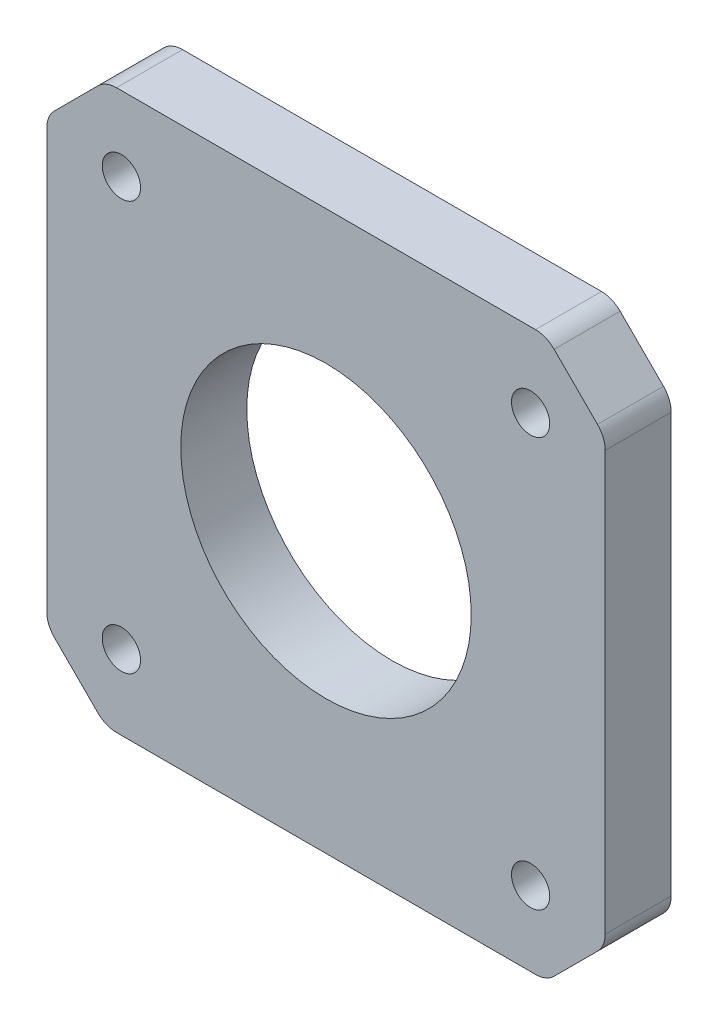
ISO-10303-21;
HEADER;
FILE_DESCRIPTION(('STEP AP214'),'2;1');
FILE_NAME('part.step','',(''),(''),'','','');
FILE_SCHEMA(('AUTOMOTIVE_DESIGN { 1 0 10303 214 1 1 1 1 }'));
ENDSEC;
DATA;
#1=APPLICATION_CONTEXT('core data for automotive mechanical design processes');
#2=APPLICATION_PROTOCOL_DEFINITION('international standard','automotive_design',2000,#1);
#3=PRODUCT_CONTEXT('',#1,'mechanical');
#4=PRODUCT('Part','Part','',(#3));
#5=PRODUCT_RELATED_PRODUCT_CATEGORY('part','',(#4));
#6=PRODUCT_DEFINITION_FORMATION('','',#4);
#7=PRODUCT_DEFINITION_CONTEXT('part definition',#1,'design');
#8=PRODUCT_DEFINITION('design','',#6,#7);
#9=PRODUCT_DEFINITION_SHAPE('','',#8);
#10=(LENGTH_UNIT() NAMED_UNIT(*) SI_UNIT(.MILLI.,.METRE.));
#11=(NAMED_UNIT(*) PLANE_ANGLE_UNIT() SI_UNIT($,.RADIAN.));
#12=(NAMED_UNIT(*) SI_UNIT($,.STERADIAN.) SOLID_ANGLE_UNIT());
#13=UNCERTAINTY_MEASURE_WITH_UNIT(LENGTH_MEASURE(1.E-05),#10,'distance_accuracy_value','');
#14=(GEOMETRIC_REPRESENTATION_CONTEXT(3) GLOBAL_UNCERTAINTY_ASSIGNED_CONTEXT((#13)) GLOBAL_UNIT_ASSIGNED_CONTEXT((#10,
#11,#12)) REPRESENTATION_CONTEXT('',''));
#15=CARTESIAN_POINT('',(0.,0.,0.));
#16=DIRECTION('',(0.,0.,1.));
#17=DIRECTION('',(1.,0.,0.));
#18=AXIS2_PLACEMENT_3D('',#15,#16,#17);
#19=CARTESIAN_POINT('',(-19.1500000000002,-15.867157287526,5.));
#20=DIRECTION('',(0.,0.,1.));
#21=DIRECTION('',(1.,0.,0.));
#22=AXIS2_PLACEMENT_3D('',#19,#20,#21);
#23=PLANE('',#22);
#24=CARTESIAN_POINT('',(0.,0.,5.));
#25=DIRECTION('',(0.,0.,1.));
#26=DIRECTION('',(1.,0.,0.));
#27=AXIS2_PLACEMENT_3D('',#24,#25,#26);
#28=CIRCLE('',#27,11.0000000000002);
#29=CARTESIAN_POINT('',(11.0000000000002,0.,5.));
#30=VERTEX_POINT('',#29);
#31=EDGE_CURVE('E348',#30,#30,#28,.T.);
#32=ORIENTED_EDGE('',*,*,#31,.F.);
#33=EDGE_LOOP('',(#32));
#34=FACE_BOUND('',#33,.T.);
#35=CARTESIAN_POINT('',(15.5000000000001,15.5000000000005,5.));
#36=DIRECTION('',(0.,0.,1.));
#37=DIRECTION('',(1.,0.,0.));
#38=AXIS2_PLACEMENT_3D('',#35,#36,#37);
#39=CIRCLE('',#38,1.45);
#40=CARTESIAN_POINT('',(16.9500000000001,15.5000000000005,5.));
#41=VERTEX_POINT('',#40);
#42=EDGE_CURVE('E360',#41,#41,#39,.T.);
#43=ORIENTED_EDGE('',*,*,#42,.F.);
#44=EDGE_LOOP('',(#43));
#45=FACE_BOUND('',#44,.T.);
#46=CARTESIAN_POINT('',(-19.1500000000002,-15.867157287526,5.));
#47=DIRECTION('',(0.,0.,1.));
#48=DIRECTION('',(1.,0.,0.));
#49=AXIS2_PLACEMENT_3D('',#46,#47,#48);
#50=CIRCLE('',#49,1.99999999999998);
#51=CARTESIAN_POINT('',(-21.1500000000002,-15.867157287526,5.));
#52=VERTEX_POINT('',#51);
#53=CARTESIAN_POINT('',(-20.5642135623731,-17.2813708498992,5.));
#54=VERTEX_POINT('',#53);
#55=EDGE_CURVE('E209',#52,#54,#50,.T.);
#56=ORIENTED_EDGE('',*,*,#55,.T.);
#57=DIRECTION('',(0.707106781186525,-0.70710678118657,0.));
#58=VECTOR('',#57,1.);
#59=CARTESIAN_POINT('',(-20.5642135623731,-17.2813708498992,5.));
#60=LINE('',#59,#58);
#61=CARTESIAN_POINT('',(-17.2813708498986,-20.564213562374,5.));
#62=VERTEX_POINT('',#61);
#63=EDGE_CURVE('E117',#54,#62,#60,.T.);
#64=ORIENTED_EDGE('',*,*,#63,.T.);
#65=CARTESIAN_POINT('',(-15.8671572875255,-19.150000000001,5.));
#66=DIRECTION('',(0.,0.,1.));
#67=DIRECTION('',(1.,0.,0.));
#68=AXIS2_PLACEMENT_3D('',#65,#66,#67);
#69=CIRCLE('',#68,1.99999999999994);
#70=CARTESIAN_POINT('',(-15.8671572875254,-21.1500000000009,5.));
#71=VERTEX_POINT('',#70);
#72=EDGE_CURVE('E248',#62,#71,#69,.T.);
#73=ORIENTED_EDGE('',*,*,#72,.T.);
#74=DIRECTION('',(1.,0.,0.));
#75=VECTOR('',#74,1.);
#76=CARTESIAN_POINT('',(-15.8671572875254,-21.150000000001,5.));
#77=LINE('',#76,#75);
#78=CARTESIAN_POINT('',(15.867157287526,-21.1500000000001,5.));
#79=VERTEX_POINT('',#78);
#80=EDGE_CURVE('E267',#71,#79,#77,.T.);
#81=ORIENTED_EDGE('',*,*,#80,.T.);
#82=CARTESIAN_POINT('',(15.8671572875261,-19.1500000000001,5.));
#83=DIRECTION('',(0.,0.,1.));
#84=DIRECTION('',(1.,0.,0.));
#85=AXIS2_PLACEMENT_3D('',#82,#83,#84);
#86=CIRCLE('',#85,2.00000000000002);
#87=CARTESIAN_POINT('',(17.2813708498991,-20.5642135623733,5.));
#88=VERTEX_POINT('',#87);
#89=EDGE_CURVE('E264',#79,#88,#86,.T.);
#90=ORIENTED_EDGE('',*,*,#89,.T.);
#91=DIRECTION('',(0.707106781186554,0.707106781186542,0.));
#92=VECTOR('',#91,1.);
#93=CARTESIAN_POINT('',(17.2813708498991,-20.5642135623733,5.));
#94=LINE('',#93,#92);
#95=CARTESIAN_POINT('',(20.5642135623738,-17.2813708498987,5.));
#96=VERTEX_POINT('',#95);
#97=EDGE_CURVE('E266',#88,#96,#94,.T.);
#98=ORIENTED_EDGE('',*,*,#97,.T.);
#99=CARTESIAN_POINT('',(19.1500000000006,-15.8671572875255,5.));
#100=DIRECTION('',(0.,0.,1.));
#101=DIRECTION('',(1.,0.,0.));
#102=AXIS2_PLACEMENT_3D('',#99,#100,#101);
#103=CIRCLE('',#102,2.00000000000008);
#104=CARTESIAN_POINT('',(21.1500000000007,-15.8671572875255,5.));
#105=VERTEX_POINT('',#104);
#106=EDGE_CURVE('E269',#96,#105,#103,.T.);
#107=ORIENTED_EDGE('',*,*,#106,.T.);
#108=DIRECTION('',(0.,1.,0.));
#109=VECTOR('',#108,1.);
#110=CARTESIAN_POINT('',(21.1500000000007,-15.8671572875255,5.));
#111=LINE('',#110,#109);
#112=CARTESIAN_POINT('',(21.15,15.867157287526,5.));
#113=VERTEX_POINT('',#112);
#114=EDGE_CURVE('E275',#105,#113,#111,.T.);
#115=ORIENTED_EDGE('',*,*,#114,.T.);
#116=CARTESIAN_POINT('',(19.15,15.8671572875262,5.));
#117=DIRECTION('',(0.,0.,1.));
#118=DIRECTION('',(1.,0.,0.));
#119=AXIS2_PLACEMENT_3D('',#116,#117,#118);
#120=CIRCLE('',#119,1.99999999999995);
#121=CARTESIAN_POINT('',(20.5642135623732,17.2813708498992,5.));
#122=VERTEX_POINT('',#121);
#123=EDGE_CURVE('E277',#113,#122,#120,.T.);
#124=ORIENTED_EDGE('',*,*,#123,.T.);
#125=DIRECTION('',(-0.707106781186583,0.707106781186512,0.));
#126=VECTOR('',#125,1.);
#127=CARTESIAN_POINT('',(20.5642135623732,17.2813708498991,5.));
#128=LINE('',#127,#126);
#129=CARTESIAN_POINT('',(17.2813708498986,20.5642135623734,5.));
#130=VERTEX_POINT('',#129);
#131=EDGE_CURVE('E279',#122,#130,#128,.T.);
#132=ORIENTED_EDGE('',*,*,#131,.T.);
#133=CARTESIAN_POINT('',(15.8671572875256,19.1500000000004,5.));
#134=DIRECTION('',(0.,0.,1.));
#135=DIRECTION('',(1.,0.,0.));
#136=AXIS2_PLACEMENT_3D('',#133,#134,#135);
#137=CIRCLE('',#136,1.99999999999991);
#138=CARTESIAN_POINT('',(15.8671572875255,21.1500000000003,5.));
#139=VERTEX_POINT('',#138);
#140=EDGE_CURVE('E281',#130,#139,#137,.T.);
#141=ORIENTED_EDGE('',*,*,#140,.T.);
#142=DIRECTION('',(-1.,0.,0.));
#143=VECTOR('',#142,1.);
#144=CARTESIAN_POINT('',(15.8671572875255,21.1500000000003,5.));
#145=LINE('',#144,#143);
#146=CARTESIAN_POINT('',(-15.8671572875258,21.1500000000005,5.));
#147=VERTEX_POINT('',#146);
#148=EDGE_CURVE('E283',#139,#147,#145,.T.);
#149=ORIENTED_EDGE('',*,*,#148,.T.);
#150=CARTESIAN_POINT('',(-15.8671572875258,19.1500000000005,5.));
#151=DIRECTION('',(0.,0.,1.));
#152=DIRECTION('',(1.,0.,0.));
#153=AXIS2_PLACEMENT_3D('',#150,#151,#152);
#154=CIRCLE('',#153,2.00000000000003);
#155=CARTESIAN_POINT('',(-17.2813708498988,20.5642135623737,5.));
#156=VERTEX_POINT('',#155);
#157=EDGE_CURVE('E160',#147,#156,#154,.T.);
#158=ORIENTED_EDGE('',*,*,#157,.T.);
#159=DIRECTION('',(-0.707106781186592,-0.707106781186503,0.));
#160=VECTOR('',#159,1.);
#161=CARTESIAN_POINT('',(-17.2813708498988,20.5642135623738,5.));
#162=LINE('',#161,#160);
#163=CARTESIAN_POINT('',(-20.5642135623736,17.2813708498994,5.));
#164=VERTEX_POINT('',#163);
#165=EDGE_CURVE('E154',#156,#164,#162,.T.);
#166=ORIENTED_EDGE('',*,*,#165,.T.);
#167=CARTESIAN_POINT('',(-19.1500000000005,15.8671572875261,5.));
#168=DIRECTION('',(0.,0.,1.));
#169=DIRECTION('',(1.,0.,0.));
#170=AXIS2_PLACEMENT_3D('',#167,#168,#169);
#171=CIRCLE('',#170,2.00000000000013);
#172=CARTESIAN_POINT('',(-21.1500000000006,15.8671572875261,5.));
#173=VERTEX_POINT('',#172);
#174=EDGE_CURVE('E158',#164,#173,#171,.T.);
#175=ORIENTED_EDGE('',*,*,#174,.T.);
#176=DIRECTION('',(0.,-1.,0.));
#177=VECTOR('',#176,1.);
#178=CARTESIAN_POINT('',(-21.1500000000006,15.8671572875261,5.));
#179=LINE('',#178,#177);
#180=EDGE_CURVE('E50',#173,#52,#179,.T.);
#181=ORIENTED_EDGE('',*,*,#180,.T.);
#182=EDGE_LOOP('',(#56,#64,#73,#81,#90,#98,#107,#115,#124,#132,#141,#149,#158,#166,#175,#181));
#183=FACE_BOUND('',#182,.T.);
#184=CARTESIAN_POINT('',(-15.5000000000003,15.5000000000005,5.));
#185=DIRECTION('',(0.,0.,1.));
#186=DIRECTION('',(1.,0.,0.));
#187=AXIS2_PLACEMENT_3D('',#184,#185,#186);
#188=CIRCLE('',#187,1.45);
#189=CARTESIAN_POINT('',(-14.0500000000003,15.5000000000005,5.));
#190=VERTEX_POINT('',#189);
#191=EDGE_CURVE('E182',#190,#190,#188,.T.);
#192=ORIENTED_EDGE('',*,*,#191,.F.);
#193=EDGE_LOOP('',(#192));
#194=FACE_BOUND('',#193,.T.);
#195=CARTESIAN_POINT('',(15.5000000000004,-15.5000000000001,5.));
#196=DIRECTION('',(0.,0.,1.));
#197=DIRECTION('',(1.,0.,0.));
#198=AXIS2_PLACEMENT_3D('',#195,#196,#197);
#199=CIRCLE('',#198,1.45);
#200=CARTESIAN_POINT('',(16.9500000000004,-15.5000000000001,5.));
#201=VERTEX_POINT('',#200);
#202=EDGE_CURVE('E354',#201,#201,#199,.T.);
#203=ORIENTED_EDGE('',*,*,#202,.F.);
#204=EDGE_LOOP('',(#203));
#205=FACE_BOUND('',#204,.T.);
#206=CARTESIAN_POINT('',(-15.5000000000003,-15.5000000000001,5.));
#207=DIRECTION('',(0.,0.,1.));
#208=DIRECTION('',(1.,0.,0.));
#209=AXIS2_PLACEMENT_3D('',#206,#207,#208);
#210=CIRCLE('',#209,1.45);
#211=CARTESIAN_POINT('',(-14.0500000000003,-15.5000000000001,5.));
#212=VERTEX_POINT('',#211);
#213=EDGE_CURVE('E339',#212,#212,#210,.T.);
#214=ORIENTED_EDGE('',*,*,#213,.F.);
#215=EDGE_LOOP('',(#214));
#216=FACE_BOUND('',#215,.T.);
#217=ADVANCED_FACE('F33',(#34,#45,#183,#194,#205,#216),#23,.T.);
#218=CARTESIAN_POINT('',(-19.1500000000002,-15.867157287526,0.));
#219=DIRECTION('',(0.,0.,1.));
#220=DIRECTION('',(1.,0.,0.));
#221=AXIS2_PLACEMENT_3D('',#218,#219,#220);
#222=PLANE('',#221);
#223=CARTESIAN_POINT('',(0.,0.,0.));
#224=DIRECTION('',(0.,0.,1.));
#225=DIRECTION('',(1.,0.,0.));
#226=AXIS2_PLACEMENT_3D('',#223,#224,#225);
#227=CIRCLE('',#226,11.0000000000002);
#228=CARTESIAN_POINT('',(11.0000000000002,0.,0.));
#229=VERTEX_POINT('',#228);
#230=EDGE_CURVE('E345',#229,#229,#227,.T.);
#231=ORIENTED_EDGE('',*,*,#230,.T.);
#232=EDGE_LOOP('',(#231));
#233=FACE_BOUND('',#232,.T.);
#234=CARTESIAN_POINT('',(15.5000000000001,15.5000000000005,0.));
#235=DIRECTION('',(0.,0.,1.));
#236=DIRECTION('',(1.,0.,0.));
#237=AXIS2_PLACEMENT_3D('',#234,#235,#236);
#238=CIRCLE('',#237,1.45);
#239=CARTESIAN_POINT('',(16.9500000000001,15.5000000000005,0.));
#240=VERTEX_POINT('',#239);
#241=EDGE_CURVE('E357',#240,#240,#238,.T.);
#242=ORIENTED_EDGE('',*,*,#241,.T.);
#243=EDGE_LOOP('',(#242));
#244=FACE_BOUND('',#243,.T.);
#245=CARTESIAN_POINT('',(-19.1500000000002,-15.867157287526,0.));
#246=DIRECTION('',(0.,0.,1.));
#247=DIRECTION('',(1.,0.,0.));
#248=AXIS2_PLACEMENT_3D('',#245,#246,#247);
#249=CIRCLE('',#248,1.99999999999998);
#250=CARTESIAN_POINT('',(-21.1500000000002,-15.867157287526,0.));
#251=VERTEX_POINT('',#250);
#252=CARTESIAN_POINT('',(-20.5642135623731,-17.2813708498992,0.));
#253=VERTEX_POINT('',#252);
#254=EDGE_CURVE('E178',#251,#253,#249,.T.);
#255=ORIENTED_EDGE('',*,*,#254,.F.);
#256=DIRECTION('',(0.,-1.,0.));
#257=VECTOR('',#256,1.);
#258=CARTESIAN_POINT('',(-21.1500000000006,15.8671572875261,0.));
#259=LINE('',#258,#257);
#260=CARTESIAN_POINT('',(-21.1500000000006,15.8671572875261,0.));
#261=VERTEX_POINT('',#260);
#262=EDGE_CURVE('E109',#261,#251,#259,.T.);
#263=ORIENTED_EDGE('',*,*,#262,.F.);
#264=CARTESIAN_POINT('',(-19.1500000000005,15.8671572875261,0.));
#265=DIRECTION('',(0.,0.,1.));
#266=DIRECTION('',(1.,0.,0.));
#267=AXIS2_PLACEMENT_3D('',#264,#265,#266);
#268=CIRCLE('',#267,2.00000000000013);
#269=CARTESIAN_POINT('',(-20.5642135623736,17.2813708498994,0.));
#270=VERTEX_POINT('',#269);
#271=EDGE_CURVE('E103',#270,#261,#268,.T.);
#272=ORIENTED_EDGE('',*,*,#271,.F.);
#273=DIRECTION('',(-0.707106781186592,-0.707106781186503,0.));
#274=VECTOR('',#273,1.);
#275=CARTESIAN_POINT('',(-17.2813708498988,20.5642135623738,0.));
#276=LINE('',#275,#274);
#277=CARTESIAN_POINT('',(-17.2813708498988,20.5642135623737,0.));
#278=VERTEX_POINT('',#277);
#279=EDGE_CURVE('E168',#278,#270,#276,.T.);
#280=ORIENTED_EDGE('',*,*,#279,.F.);
#281=CARTESIAN_POINT('',(-15.8671572875258,19.1500000000005,0.));
#282=DIRECTION('',(0.,0.,1.));
#283=DIRECTION('',(1.,0.,0.));
#284=AXIS2_PLACEMENT_3D('',#281,#282,#283);
#285=CIRCLE('',#284,2.00000000000003);
#286=CARTESIAN_POINT('',(-15.8671572875258,21.1500000000005,0.));
#287=VERTEX_POINT('',#286);
#288=EDGE_CURVE('E204',#287,#278,#285,.T.);
#289=ORIENTED_EDGE('',*,*,#288,.F.);
#290=DIRECTION('',(-1.,0.,0.));
#291=VECTOR('',#290,1.);
#292=CARTESIAN_POINT('',(15.8671572875255,21.1500000000003,0.));
#293=LINE('',#292,#291);
#294=CARTESIAN_POINT('',(15.8671572875255,21.1500000000003,0.));
#295=VERTEX_POINT('',#294);
#296=EDGE_CURVE('E202',#295,#287,#293,.T.);
#297=ORIENTED_EDGE('',*,*,#296,.F.);
#298=CARTESIAN_POINT('',(15.8671572875256,19.1500000000004,0.));
#299=DIRECTION('',(0.,0.,1.));
#300=DIRECTION('',(1.,0.,0.));
#301=AXIS2_PLACEMENT_3D('',#298,#299,#300);
#302=CIRCLE('',#301,1.99999999999991);
#303=CARTESIAN_POINT('',(17.2813708498986,20.5642135623734,0.));
#304=VERTEX_POINT('',#303);
#305=EDGE_CURVE('E200',#304,#295,#302,.T.);
#306=ORIENTED_EDGE('',*,*,#305,.F.);
#307=DIRECTION('',(-0.707106781186583,0.707106781186512,0.));
#308=VECTOR('',#307,1.);
#309=CARTESIAN_POINT('',(20.5642135623732,17.2813708498991,0.));
#310=LINE('',#309,#308);
#311=CARTESIAN_POINT('',(20.5642135623732,17.2813708498992,0.));
#312=VERTEX_POINT('',#311);
#313=EDGE_CURVE('E198',#312,#304,#310,.T.);
#314=ORIENTED_EDGE('',*,*,#313,.F.);
#315=CARTESIAN_POINT('',(19.15,15.8671572875262,0.));
#316=DIRECTION('',(0.,0.,1.));
#317=DIRECTION('',(1.,0.,0.));
#318=AXIS2_PLACEMENT_3D('',#315,#316,#317);
#319=CIRCLE('',#318,1.99999999999995);
#320=CARTESIAN_POINT('',(21.15,15.867157287526,0.));
#321=VERTEX_POINT('',#320);
#322=EDGE_CURVE('E196',#321,#312,#319,.T.);
#323=ORIENTED_EDGE('',*,*,#322,.F.);
#324=DIRECTION('',(0.,1.,0.));
#325=VECTOR('',#324,1.);
#326=CARTESIAN_POINT('',(21.1500000000007,-15.8671572875255,0.));
#327=LINE('',#326,#325);
#328=CARTESIAN_POINT('',(21.1500000000007,-15.8671572875255,0.));
#329=VERTEX_POINT('',#328);
#330=EDGE_CURVE('E194',#329,#321,#327,.T.);
#331=ORIENTED_EDGE('',*,*,#330,.F.);
#332=CARTESIAN_POINT('',(19.1500000000006,-15.8671572875255,0.));
#333=DIRECTION('',(0.,0.,1.));
#334=DIRECTION('',(1.,0.,0.));
#335=AXIS2_PLACEMENT_3D('',#332,#333,#334);
#336=CIRCLE('',#335,2.00000000000008);
#337=CARTESIAN_POINT('',(20.5642135623738,-17.2813708498987,0.));
#338=VERTEX_POINT('',#337);
#339=EDGE_CURVE('E192',#338,#329,#336,.T.);
#340=ORIENTED_EDGE('',*,*,#339,.F.);
#341=DIRECTION('',(0.707106781186554,0.707106781186542,0.));
#342=VECTOR('',#341,1.);
#343=CARTESIAN_POINT('',(17.2813708498991,-20.5642135623733,0.));
#344=LINE('',#343,#342);
#345=CARTESIAN_POINT('',(17.2813708498991,-20.5642135623733,0.));
#346=VERTEX_POINT('',#345);
#347=EDGE_CURVE('E190',#346,#338,#344,.T.);
#348=ORIENTED_EDGE('',*,*,#347,.F.);
#349=CARTESIAN_POINT('',(15.8671572875261,-19.1500000000001,0.));
#350=DIRECTION('',(0.,0.,1.));
#351=DIRECTION('',(1.,0.,0.));
#352=AXIS2_PLACEMENT_3D('',#349,#350,#351);
#353=CIRCLE('',#352,2.00000000000002);
#354=CARTESIAN_POINT('',(15.867157287526,-21.1500000000001,0.));
#355=VERTEX_POINT('',#354);
#356=EDGE_CURVE('E188',#355,#346,#353,.T.);
#357=ORIENTED_EDGE('',*,*,#356,.F.);
#358=DIRECTION('',(1.,0.,0.));
#359=VECTOR('',#358,1.);
#360=CARTESIAN_POINT('',(-15.8671572875254,-21.150000000001,0.));
#361=LINE('',#360,#359);
#362=CARTESIAN_POINT('',(-15.8671572875254,-21.1500000000009,0.));
#363=VERTEX_POINT('',#362);
#364=EDGE_CURVE('E186',#363,#355,#361,.T.);
#365=ORIENTED_EDGE('',*,*,#364,.F.);
#366=CARTESIAN_POINT('',(-15.8671572875255,-19.150000000001,0.));
#367=DIRECTION('',(0.,0.,1.));
#368=DIRECTION('',(1.,0.,0.));
#369=AXIS2_PLACEMENT_3D('',#366,#367,#368);
#370=CIRCLE('',#369,1.99999999999994);
#371=CARTESIAN_POINT('',(-17.2813708498986,-20.564213562374,0.));
#372=VERTEX_POINT('',#371);
#373=EDGE_CURVE('E184',#372,#363,#370,.T.);
#374=ORIENTED_EDGE('',*,*,#373,.F.);
#375=DIRECTION('',(0.707106781186525,-0.70710678118657,0.));
#376=VECTOR('',#375,1.);
#377=CARTESIAN_POINT('',(-20.5642135623731,-17.2813708498992,0.));
#378=LINE('',#377,#376);
#379=EDGE_CURVE('E181',#253,#372,#378,.T.);
#380=ORIENTED_EDGE('',*,*,#379,.F.);
#381=EDGE_LOOP('',(#255,#263,#272,#280,#289,#297,#306,#314,#323,#331,#340,#348,#357,#365,#374,#380));
#382=FACE_BOUND('',#381,.T.);
#383=CARTESIAN_POINT('',(-15.5000000000003,15.5000000000005,0.));
#384=DIRECTION('',(0.,0.,1.));
#385=DIRECTION('',(1.,0.,0.));
#386=AXIS2_PLACEMENT_3D('',#383,#384,#385);
#387=CIRCLE('',#386,1.45);
#388=CARTESIAN_POINT('',(-14.0500000000003,15.5000000000005,0.));
#389=VERTEX_POINT('',#388);
#390=EDGE_CURVE('E363',#389,#389,#387,.T.);
#391=ORIENTED_EDGE('',*,*,#390,.T.);
#392=EDGE_LOOP('',(#391));
#393=FACE_BOUND('',#392,.T.);
#394=CARTESIAN_POINT('',(15.5000000000004,-15.5000000000001,0.));
#395=DIRECTION('',(0.,0.,1.));
#396=DIRECTION('',(1.,0.,0.));
#397=AXIS2_PLACEMENT_3D('',#394,#395,#396);
#398=CIRCLE('',#397,1.45);
#399=CARTESIAN_POINT('',(16.9500000000004,-15.5000000000001,0.));
#400=VERTEX_POINT('',#399);
#401=EDGE_CURVE('E351',#400,#400,#398,.T.);
#402=ORIENTED_EDGE('',*,*,#401,.T.);
#403=EDGE_LOOP('',(#402));
#404=FACE_BOUND('',#403,.T.);
#405=CARTESIAN_POINT('',(-15.5000000000003,-15.5000000000001,0.));
#406=DIRECTION('',(0.,0.,1.));
#407=DIRECTION('',(1.,0.,0.));
#408=AXIS2_PLACEMENT_3D('',#405,#406,#407);
#409=CIRCLE('',#408,1.45);
#410=CARTESIAN_POINT('',(-14.0500000000003,-15.5000000000001,0.));
#411=VERTEX_POINT('',#410);
#412=EDGE_CURVE('E342',#411,#411,#409,.T.);
#413=ORIENTED_EDGE('',*,*,#412,.T.);
#414=EDGE_LOOP('',(#413));
#415=FACE_BOUND('',#414,.T.);
#416=ADVANCED_FACE('F252',(#233,#244,#382,#393,#404,#415),#222,.F.);
#417=CARTESIAN_POINT('',(-19.1500000000002,-15.867157287526,5.));
#418=DIRECTION('',(0.,0.,-1.));
#419=DIRECTION('',(-1.,0.,0.));
#420=AXIS2_PLACEMENT_3D('',#417,#418,#419);
#421=CYLINDRICAL_SURFACE('',#420,1.99999999999998);
#422=ORIENTED_EDGE('',*,*,#254,.T.);
#423=DIRECTION('',(0.,0.,-1.));
#424=VECTOR('',#423,1.);
#425=CARTESIAN_POINT('',(-20.5642135623731,-17.2813708498992,5.));
#426=LINE('',#425,#424);
#427=EDGE_CURVE('E11',#54,#253,#426,.T.);
#428=ORIENTED_EDGE('',*,*,#427,.F.);
#429=ORIENTED_EDGE('',*,*,#55,.F.);
#430=DIRECTION('',(0.,0.,-1.));
#431=VECTOR('',#430,1.);
#432=CARTESIAN_POINT('',(-21.1500000000002,-15.867157287526,5.));
#433=LINE('',#432,#431);
#434=EDGE_CURVE('E174',#52,#251,#433,.T.);
#435=ORIENTED_EDGE('',*,*,#434,.T.);
#436=EDGE_LOOP('',(#422,#428,#429,#435));
#437=FACE_BOUND('',#436,.T.);
#438=ADVANCED_FACE('F35',(#437),#421,.T.);
#439=CARTESIAN_POINT('',(-20.5642135623731,-17.2813708498992,5.));
#440=DIRECTION('',(0.70710678118657,0.707106781186525,0.));
#441=DIRECTION('',(-0.707106781186525,0.70710678118657,0.));
#442=AXIS2_PLACEMENT_3D('',#439,#440,#441);
#443=PLANE('',#442);
#444=ORIENTED_EDGE('',*,*,#379,.T.);
#445=DIRECTION('',(0.,0.,-1.));
#446=VECTOR('',#445,1.);
#447=CARTESIAN_POINT('',(-17.2813708498986,-20.564213562374,5.));
#448=LINE('',#447,#446);
#449=EDGE_CURVE('E42',#62,#372,#448,.T.);
#450=ORIENTED_EDGE('',*,*,#449,.F.);
#451=ORIENTED_EDGE('',*,*,#63,.F.);
#452=ORIENTED_EDGE('',*,*,#427,.T.);
#453=EDGE_LOOP('',(#444,#450,#451,#452));
#454=FACE_BOUND('',#453,.T.);
#455=ADVANCED_FACE('F521',(#454),#443,.F.);
#456=CARTESIAN_POINT('',(-15.8671572875255,-19.150000000001,5.));
#457=DIRECTION('',(0.,0.,-1.));
#458=DIRECTION('',(-1.,0.,0.));
#459=AXIS2_PLACEMENT_3D('',#456,#457,#458);
#460=CYLINDRICAL_SURFACE('',#459,1.99999999999994);
#461=ORIENTED_EDGE('',*,*,#373,.T.);
#462=DIRECTION('',(0.,0.,-1.));
#463=VECTOR('',#462,1.);
#464=CARTESIAN_POINT('',(-15.8671572875254,-21.1500000000009,5.));
#465=LINE('',#464,#463);
#466=EDGE_CURVE('E240',#71,#363,#465,.T.);
#467=ORIENTED_EDGE('',*,*,#466,.F.);
#468=ORIENTED_EDGE('',*,*,#72,.F.);
#469=ORIENTED_EDGE('',*,*,#449,.T.);
#470=EDGE_LOOP('',(#461,#467,#468,#469));
#471=FACE_BOUND('',#470,.T.);
#472=ADVANCED_FACE('F246',(#471),#460,.T.);
#473=CARTESIAN_POINT('',(-15.8671572875254,-21.150000000001,5.));
#474=DIRECTION('',(0.,1.,0.));
#475=DIRECTION('',(-1.,0.,0.));
#476=AXIS2_PLACEMENT_3D('',#473,#474,#475);
#477=PLANE('',#476);
#478=ORIENTED_EDGE('',*,*,#364,.T.);
#479=DIRECTION('',(0.,0.,-1.));
#480=VECTOR('',#479,1.);
#481=CARTESIAN_POINT('',(15.867157287526,-21.1500000000001,5.));
#482=LINE('',#481,#480);
#483=EDGE_CURVE('E237',#79,#355,#482,.T.);
#484=ORIENTED_EDGE('',*,*,#483,.F.);
#485=ORIENTED_EDGE('',*,*,#80,.F.);
#486=ORIENTED_EDGE('',*,*,#466,.T.);
#487=EDGE_LOOP('',(#478,#484,#485,#486));
#488=FACE_BOUND('',#487,.T.);
#489=ADVANCED_FACE('F258',(#488),#477,.F.);
#490=CARTESIAN_POINT('',(15.8671572875261,-19.1500000000001,5.));
#491=DIRECTION('',(0.,0.,-1.));
#492=DIRECTION('',(-1.,0.,0.));
#493=AXIS2_PLACEMENT_3D('',#490,#491,#492);
#494=CYLINDRICAL_SURFACE('',#493,2.00000000000002);
#495=ORIENTED_EDGE('',*,*,#356,.T.);
#496=DIRECTION('',(0.,0.,-1.));
#497=VECTOR('',#496,1.);
#498=CARTESIAN_POINT('',(17.2813708498991,-20.5642135623733,5.));
#499=LINE('',#498,#497);
#500=EDGE_CURVE('E234',#88,#346,#499,.T.);
#501=ORIENTED_EDGE('',*,*,#500,.F.);
#502=ORIENTED_EDGE('',*,*,#89,.F.);
#503=ORIENTED_EDGE('',*,*,#483,.T.);
#504=EDGE_LOOP('',(#495,#501,#502,#503));
#505=FACE_BOUND('',#504,.T.);
#506=ADVANCED_FACE('F262',(#505),#494,.T.);
#507=CARTESIAN_POINT('',(17.2813708498991,-20.5642135623733,5.));
#508=DIRECTION('',(-0.707106781186542,0.707106781186554,0.));
#509=DIRECTION('',(-0.707106781186554,-0.707106781186542,0.));
#510=AXIS2_PLACEMENT_3D('',#507,#508,#509);
#511=PLANE('',#510);
#512=ORIENTED_EDGE('',*,*,#347,.T.);
#513=DIRECTION('',(0.,0.,-1.));
#514=VECTOR('',#513,1.);
#515=CARTESIAN_POINT('',(20.5642135623738,-17.2813708498987,5.));
#516=LINE('',#515,#514);
#517=EDGE_CURVE('E231',#96,#338,#516,.T.);
#518=ORIENTED_EDGE('',*,*,#517,.F.);
#519=ORIENTED_EDGE('',*,*,#97,.F.);
#520=ORIENTED_EDGE('',*,*,#500,.T.);
#521=EDGE_LOOP('',(#512,#518,#519,#520));
#522=FACE_BOUND('',#521,.T.);
#523=ADVANCED_FACE('F486',(#522),#511,.F.);
#524=CARTESIAN_POINT('',(19.1500000000006,-15.8671572875255,5.));
#525=DIRECTION('',(0.,0.,-1.));
#526=DIRECTION('',(-1.,0.,0.));
#527=AXIS2_PLACEMENT_3D('',#524,#525,#526);
#528=CYLINDRICAL_SURFACE('',#527,2.00000000000008);
#529=ORIENTED_EDGE('',*,*,#339,.T.);
#530=DIRECTION('',(0.,0.,-1.));
#531=VECTOR('',#530,1.);
#532=CARTESIAN_POINT('',(21.1500000000007,-15.8671572875255,5.));
#533=LINE('',#532,#531);
#534=EDGE_CURVE('E228',#105,#329,#533,.T.);
#535=ORIENTED_EDGE('',*,*,#534,.F.);
#536=ORIENTED_EDGE('',*,*,#106,.F.);
#537=ORIENTED_EDGE('',*,*,#517,.T.);
#538=EDGE_LOOP('',(#529,#535,#536,#537));
#539=FACE_BOUND('',#538,.T.);
#540=ADVANCED_FACE('F476',(#539),#528,.T.);
#541=CARTESIAN_POINT('',(21.1500000000007,-15.8671572875255,5.));
#542=DIRECTION('',(-1.,0.,0.));
#543=DIRECTION('',(0.,-1.,0.));
#544=AXIS2_PLACEMENT_3D('',#541,#542,#543);
#545=PLANE('',#544);
#546=ORIENTED_EDGE('',*,*,#330,.T.);
#547=DIRECTION('',(0.,0.,-1.));
#548=VECTOR('',#547,1.);
#549=CARTESIAN_POINT('',(21.15,15.867157287526,5.));
#550=LINE('',#549,#548);
#551=EDGE_CURVE('E225',#113,#321,#550,.T.);
#552=ORIENTED_EDGE('',*,*,#551,.F.);
#553=ORIENTED_EDGE('',*,*,#114,.F.);
#554=ORIENTED_EDGE('',*,*,#534,.T.);
#555=EDGE_LOOP('',(#546,#552,#553,#554));
#556=FACE_BOUND('',#555,.T.);
#557=ADVANCED_FACE('F466',(#556),#545,.F.);
#558=CARTESIAN_POINT('',(19.15,15.8671572875262,5.));
#559=DIRECTION('',(0.,0.,-1.));
#560=DIRECTION('',(-1.,0.,0.));
#561=AXIS2_PLACEMENT_3D('',#558,#559,#560);
#562=CYLINDRICAL_SURFACE('',#561,1.99999999999995);
#563=ORIENTED_EDGE('',*,*,#322,.T.);
#564=DIRECTION('',(0.,0.,-1.));
#565=VECTOR('',#564,1.);
#566=CARTESIAN_POINT('',(20.5642135623732,17.2813708498992,5.));
#567=LINE('',#566,#565);
#568=EDGE_CURVE('E222',#122,#312,#567,.T.);
#569=ORIENTED_EDGE('',*,*,#568,.F.);
#570=ORIENTED_EDGE('',*,*,#123,.F.);
#571=ORIENTED_EDGE('',*,*,#551,.T.);
#572=EDGE_LOOP('',(#563,#569,#570,#571));
#573=FACE_BOUND('',#572,.T.);
#574=ADVANCED_FACE('F456',(#573),#562,.T.);
#575=CARTESIAN_POINT('',(20.5642135623732,17.2813708498991,5.));
#576=DIRECTION('',(-0.707106781186512,-0.707106781186583,0.));
#577=DIRECTION('',(0.707106781186583,-0.707106781186512,0.));
#578=AXIS2_PLACEMENT_3D('',#575,#576,#577);
#579=PLANE('',#578);
#580=ORIENTED_EDGE('',*,*,#313,.T.);
#581=DIRECTION('',(0.,0.,-1.));
#582=VECTOR('',#581,1.);
#583=CARTESIAN_POINT('',(17.2813708498986,20.5642135623734,5.));
#584=LINE('',#583,#582);
#585=EDGE_CURVE('E219',#130,#304,#584,.T.);
#586=ORIENTED_EDGE('',*,*,#585,.F.);
#587=ORIENTED_EDGE('',*,*,#131,.F.);
#588=ORIENTED_EDGE('',*,*,#568,.T.);
#589=EDGE_LOOP('',(#580,#586,#587,#588));
#590=FACE_BOUND('',#589,.T.);
#591=ADVANCED_FACE('F446',(#590),#579,.F.);
#592=CARTESIAN_POINT('',(15.8671572875256,19.1500000000004,5.));
#593=DIRECTION('',(0.,0.,-1.));
#594=DIRECTION('',(-1.,0.,0.));
#595=AXIS2_PLACEMENT_3D('',#592,#593,#594);
#596=CYLINDRICAL_SURFACE('',#595,1.99999999999991);
#597=ORIENTED_EDGE('',*,*,#305,.T.);
#598=DIRECTION('',(0.,0.,-1.));
#599=VECTOR('',#598,1.);
#600=CARTESIAN_POINT('',(15.8671572875255,21.1500000000003,5.));
#601=LINE('',#600,#599);
#602=EDGE_CURVE('E216',#139,#295,#601,.T.);
#603=ORIENTED_EDGE('',*,*,#602,.F.);
#604=ORIENTED_EDGE('',*,*,#140,.F.);
#605=ORIENTED_EDGE('',*,*,#585,.T.);
#606=EDGE_LOOP('',(#597,#603,#604,#605));
#607=FACE_BOUND('',#606,.T.);
#608=ADVANCED_FACE('F437',(#607),#596,.T.);
#609=CARTESIAN_POINT('',(15.8671572875255,21.1500000000003,5.));
#610=DIRECTION('',(0.,-1.,0.));
#611=DIRECTION('',(1.,0.,0.));
#612=AXIS2_PLACEMENT_3D('',#609,#610,#611);
#613=PLANE('',#612);
#614=ORIENTED_EDGE('',*,*,#296,.T.);
#615=DIRECTION('',(0.,0.,-1.));
#616=VECTOR('',#615,1.);
#617=CARTESIAN_POINT('',(-15.8671572875258,21.1500000000005,5.));
#618=LINE('',#617,#616);
#619=EDGE_CURVE('E213',#147,#287,#618,.T.);
#620=ORIENTED_EDGE('',*,*,#619,.F.);
#621=ORIENTED_EDGE('',*,*,#148,.F.);
#622=ORIENTED_EDGE('',*,*,#602,.T.);
#623=EDGE_LOOP('',(#614,#620,#621,#622));
#624=FACE_BOUND('',#623,.T.);
#625=ADVANCED_FACE('F289',(#624),#613,.F.);
#626=CARTESIAN_POINT('',(-15.8671572875258,19.1500000000005,5.));
#627=DIRECTION('',(0.,0.,-1.));
#628=DIRECTION('',(-1.,0.,0.));
#629=AXIS2_PLACEMENT_3D('',#626,#627,#628);
#630=CYLINDRICAL_SURFACE('',#629,2.00000000000003);
#631=ORIENTED_EDGE('',*,*,#288,.T.);
#632=DIRECTION('',(0.,0.,-1.));
#633=VECTOR('',#632,1.);
#634=CARTESIAN_POINT('',(-17.2813708498988,20.5642135623737,5.));
#635=LINE('',#634,#633);
#636=EDGE_CURVE('E169',#156,#278,#635,.T.);
#637=ORIENTED_EDGE('',*,*,#636,.F.);
#638=ORIENTED_EDGE('',*,*,#157,.F.);
#639=ORIENTED_EDGE('',*,*,#619,.T.);
#640=EDGE_LOOP('',(#631,#637,#638,#639));
#641=FACE_BOUND('',#640,.T.);
#642=ADVANCED_FACE('F293',(#641),#630,.T.);
#643=CARTESIAN_POINT('',(-17.2813708498988,20.5642135623738,5.));
#644=DIRECTION('',(0.707106781186503,-0.707106781186592,0.));
#645=DIRECTION('',(0.707106781186592,0.707106781186503,0.));
#646=AXIS2_PLACEMENT_3D('',#643,#644,#645);
#647=PLANE('',#646);
#648=ORIENTED_EDGE('',*,*,#279,.T.);
#649=DIRECTION('',(0.,0.,-1.));
#650=VECTOR('',#649,1.);
#651=CARTESIAN_POINT('',(-20.5642135623736,17.2813708498994,5.));
#652=LINE('',#651,#650);
#653=EDGE_CURVE('E165',#164,#270,#652,.T.);
#654=ORIENTED_EDGE('',*,*,#653,.F.);
#655=ORIENTED_EDGE('',*,*,#165,.F.);
#656=ORIENTED_EDGE('',*,*,#636,.T.);
#657=EDGE_LOOP('',(#648,#654,#655,#656));
#658=FACE_BOUND('',#657,.T.);
#659=ADVANCED_FACE('F166',(#658),#647,.F.);
#660=CARTESIAN_POINT('',(-19.1500000000005,15.8671572875261,5.));
#661=DIRECTION('',(0.,0.,-1.));
#662=DIRECTION('',(-1.,0.,0.));
#663=AXIS2_PLACEMENT_3D('',#660,#661,#662);
#664=CYLINDRICAL_SURFACE('',#663,2.00000000000013);
#665=ORIENTED_EDGE('',*,*,#271,.T.);
#666=DIRECTION('',(0.,0.,-1.));
#667=VECTOR('',#666,1.);
#668=CARTESIAN_POINT('',(-21.1500000000006,15.8671572875261,5.));
#669=LINE('',#668,#667);
#670=EDGE_CURVE('E170',#173,#261,#669,.T.);
#671=ORIENTED_EDGE('',*,*,#670,.F.);
#672=ORIENTED_EDGE('',*,*,#174,.F.);
#673=ORIENTED_EDGE('',*,*,#653,.T.);
#674=EDGE_LOOP('',(#665,#671,#672,#673));
#675=FACE_BOUND('',#674,.T.);
#676=ADVANCED_FACE('F172',(#675),#664,.T.);
#677=CARTESIAN_POINT('',(-21.1500000000006,15.8671572875261,5.));
#678=DIRECTION('',(1.,0.,0.));
#679=DIRECTION('',(0.,1.,0.));
#680=AXIS2_PLACEMENT_3D('',#677,#678,#679);
#681=PLANE('',#680);
#682=ORIENTED_EDGE('',*,*,#262,.T.);
#683=ORIENTED_EDGE('',*,*,#434,.F.);
#684=ORIENTED_EDGE('',*,*,#180,.F.);
#685=ORIENTED_EDGE('',*,*,#670,.T.);
#686=EDGE_LOOP('',(#682,#683,#684,#685));
#687=FACE_BOUND('',#686,.T.);
#688=ADVANCED_FACE('F297',(#687),#681,.F.);
#689=CARTESIAN_POINT('',(-15.5000000000003,15.5000000000005,5.));
#690=DIRECTION('',(0.,0.,-1.));
#691=DIRECTION('',(-1.,0.,0.));
#692=AXIS2_PLACEMENT_3D('',#689,#690,#691);
#693=CYLINDRICAL_SURFACE('',#692,1.45);
#694=ORIENTED_EDGE('',*,*,#191,.T.);
#695=EDGE_LOOP('',(#694));
#696=FACE_BOUND('',#695,.T.);
#697=ORIENTED_EDGE('',*,*,#390,.F.);
#698=EDGE_LOOP('',(#697));
#699=FACE_BOUND('',#698,.T.);
#700=ADVANCED_FACE('F299',(#696,#699),#693,.F.);
#701=CARTESIAN_POINT('',(15.5000000000001,15.5000000000005,5.));
#702=DIRECTION('',(0.,0.,-1.));
#703=DIRECTION('',(-1.,0.,0.));
#704=AXIS2_PLACEMENT_3D('',#701,#702,#703);
#705=CYLINDRICAL_SURFACE('',#704,1.45);
#706=ORIENTED_EDGE('',*,*,#42,.T.);
#707=EDGE_LOOP('',(#706));
#708=FACE_BOUND('',#707,.T.);
#709=ORIENTED_EDGE('',*,*,#241,.F.);
#710=EDGE_LOOP('',(#709));
#711=FACE_BOUND('',#710,.T.);
#712=ADVANCED_FACE('F305',(#708,#711),#705,.F.);
#713=CARTESIAN_POINT('',(15.5000000000004,-15.5000000000001,5.));
#714=DIRECTION('',(0.,0.,-1.));
#715=DIRECTION('',(-1.,0.,0.));
#716=AXIS2_PLACEMENT_3D('',#713,#714,#715);
#717=CYLINDRICAL_SURFACE('',#716,1.45);
#718=ORIENTED_EDGE('',*,*,#202,.T.);
#719=EDGE_LOOP('',(#718));
#720=FACE_BOUND('',#719,.T.);
#721=ORIENTED_EDGE('',*,*,#401,.F.);
#722=EDGE_LOOP('',(#721));
#723=FACE_BOUND('',#722,.T.);
#724=ADVANCED_FACE('F322',(#720,#723),#717,.F.);
#725=CARTESIAN_POINT('',(0.,0.,5.));
#726=DIRECTION('',(0.,0.,-1.));
#727=DIRECTION('',(-1.,0.,0.));
#728=AXIS2_PLACEMENT_3D('',#725,#726,#727);
#729=CYLINDRICAL_SURFACE('',#728,11.0000000000002);
#730=ORIENTED_EDGE('',*,*,#31,.T.);
#731=EDGE_LOOP('',(#730));
#732=FACE_BOUND('',#731,.T.);
#733=ORIENTED_EDGE('',*,*,#230,.F.);
#734=EDGE_LOOP('',(#733));
#735=FACE_BOUND('',#734,.T.);
#736=ADVANCED_FACE('F326',(#732,#735),#729,.F.);
#737=CARTESIAN_POINT('',(-15.5000000000003,-15.5000000000001,5.));
#738=DIRECTION('',(0.,0.,-1.));
#739=DIRECTION('',(-1.,0.,0.));
#740=AXIS2_PLACEMENT_3D('',#737,#738,#739);
#741=CYLINDRICAL_SURFACE('',#740,1.45);
#742=ORIENTED_EDGE('',*,*,#213,.T.);
#743=EDGE_LOOP('',(#742));
#744=FACE_BOUND('',#743,.T.);
#745=ORIENTED_EDGE('',*,*,#412,.F.);
#746=EDGE_LOOP('',(#745));
#747=FACE_BOUND('',#746,.T.);
#748=ADVANCED_FACE('F330',(#744,#747),#741,.F.);
#749=CLOSED_SHELL('',(#217,#416,#438,#455,#472,#489,#506,#523,#540,#557,#574,#591,#608,#625,
#642,#659,#676,#688,#700,#712,#724,#736,#748));
#750=MANIFOLD_SOLID_BREP('B2',#749);
#751=ADVANCED_BREP_SHAPE_REPRESENTATION('',(#18,#750),#14);
#752=SHAPE_DEFINITION_REPRESENTATION(#9,#751);
ENDSEC;
END-ISO-10303-21;
